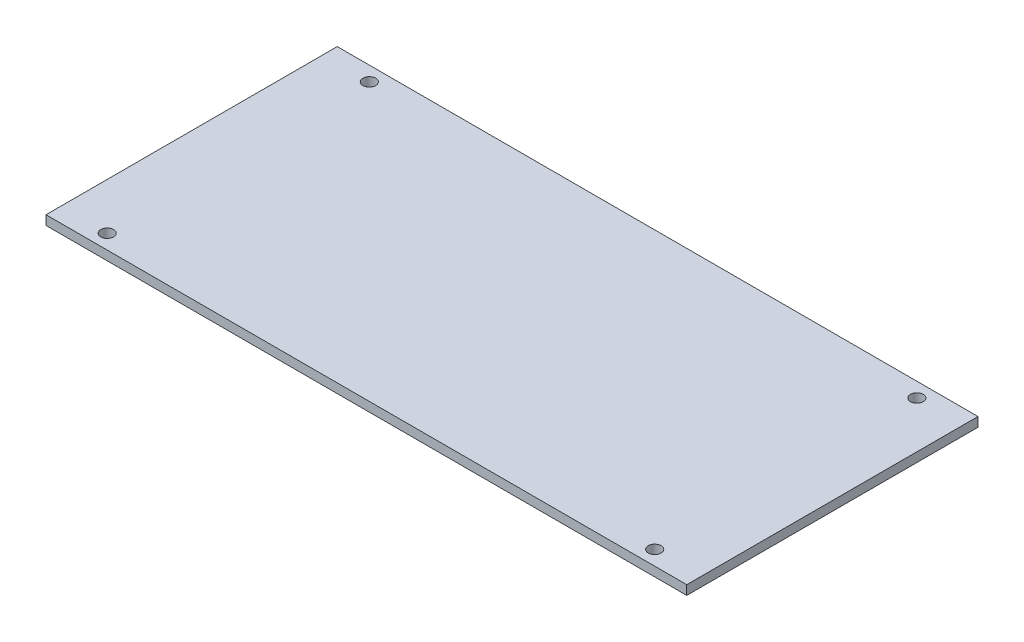
ISO-10303-21;
HEADER;
FILE_DESCRIPTION(('STEP AP214'),'2;1');
FILE_NAME('part.step','',(''),(''),'','','');
FILE_SCHEMA(('AUTOMOTIVE_DESIGN { 1 0 10303 214 1 1 1 1 }'));
ENDSEC;
DATA;
#1=APPLICATION_CONTEXT('core data for automotive mechanical design processes');
#2=APPLICATION_PROTOCOL_DEFINITION('international standard','automotive_design',2000,#1);
#3=PRODUCT_CONTEXT('',#1,'mechanical');
#4=PRODUCT('Part','Part','',(#3));
#5=PRODUCT_RELATED_PRODUCT_CATEGORY('part','',(#4));
#6=PRODUCT_DEFINITION_FORMATION('','',#4);
#7=PRODUCT_DEFINITION_CONTEXT('part definition',#1,'design');
#8=PRODUCT_DEFINITION('design','',#6,#7);
#9=PRODUCT_DEFINITION_SHAPE('','',#8);
#10=(LENGTH_UNIT() NAMED_UNIT(*) SI_UNIT(.MILLI.,.METRE.));
#11=(NAMED_UNIT(*) PLANE_ANGLE_UNIT() SI_UNIT($,.RADIAN.));
#12=(NAMED_UNIT(*) SI_UNIT($,.STERADIAN.) SOLID_ANGLE_UNIT());
#13=UNCERTAINTY_MEASURE_WITH_UNIT(LENGTH_MEASURE(1.E-05),#10,'distance_accuracy_value','');
#14=(GEOMETRIC_REPRESENTATION_CONTEXT(3) GLOBAL_UNCERTAINTY_ASSIGNED_CONTEXT((#13)) GLOBAL_UNIT_ASSIGNED_CONTEXT((#10,
#11,#12)) REPRESENTATION_CONTEXT('',''));
#15=CARTESIAN_POINT('',(0.,0.,0.));
#16=DIRECTION('',(0.,0.,1.));
#17=DIRECTION('',(1.,0.,0.));
#18=AXIS2_PLACEMENT_3D('',#15,#16,#17);
#19=CARTESIAN_POINT('',(69.85,2.032,31.75));
#20=DIRECTION('',(-1.,0.,0.));
#21=DIRECTION('',(0.,0.,1.));
#22=AXIS2_PLACEMENT_3D('',#19,#20,#21);
#23=PLANE('',#22);
#24=DIRECTION('',(0.,0.,-1.));
#25=VECTOR('',#24,1.);
#26=CARTESIAN_POINT('',(69.85,0.,31.75));
#27=LINE('',#26,#25);
#28=CARTESIAN_POINT('',(69.85,0.,31.75));
#29=VERTEX_POINT('',#28);
#30=CARTESIAN_POINT('',(69.85,0.,-31.75));
#31=VERTEX_POINT('',#30);
#32=EDGE_CURVE('E96',#29,#31,#27,.T.);
#33=ORIENTED_EDGE('',*,*,#32,.T.);
#34=DIRECTION('',(0.,-1.,0.));
#35=VECTOR('',#34,1.);
#36=CARTESIAN_POINT('',(69.85,2.032,-31.75));
#37=LINE('',#36,#35);
#38=CARTESIAN_POINT('',(69.85,2.032,-31.75));
#39=VERTEX_POINT('',#38);
#40=EDGE_CURVE('E11',#39,#31,#37,.T.);
#41=ORIENTED_EDGE('',*,*,#40,.F.);
#42=DIRECTION('',(0.,0.,-1.));
#43=VECTOR('',#42,1.);
#44=CARTESIAN_POINT('',(69.85,2.032,31.75));
#45=LINE('',#44,#43);
#46=CARTESIAN_POINT('',(69.85,2.032,31.75));
#47=VERTEX_POINT('',#46);
#48=EDGE_CURVE('E84',#47,#39,#45,.T.);
#49=ORIENTED_EDGE('',*,*,#48,.F.);
#50=DIRECTION('',(0.,-1.,0.));
#51=VECTOR('',#50,1.);
#52=CARTESIAN_POINT('',(69.85,2.032,31.75));
#53=LINE('',#52,#51);
#54=EDGE_CURVE('E92',#47,#29,#53,.T.);
#55=ORIENTED_EDGE('',*,*,#54,.T.);
#56=EDGE_LOOP('',(#33,#41,#49,#55));
#57=FACE_BOUND('',#56,.T.);
#58=ADVANCED_FACE('F33',(#57),#23,.F.);
#59=CARTESIAN_POINT('',(-69.85,2.032,-31.75));
#60=DIRECTION('',(0.,0.,1.));
#61=DIRECTION('',(1.,0.,0.));
#62=AXIS2_PLACEMENT_3D('',#59,#60,#61);
#63=PLANE('',#62);
#64=DIRECTION('',(-1.,0.,0.));
#65=VECTOR('',#64,1.);
#66=CARTESIAN_POINT('',(-69.85,0.,-31.75));
#67=LINE('',#66,#65);
#68=CARTESIAN_POINT('',(-69.85,0.,-31.75));
#69=VERTEX_POINT('',#68);
#70=EDGE_CURVE('E88',#31,#69,#67,.T.);
#71=ORIENTED_EDGE('',*,*,#70,.T.);
#72=DIRECTION('',(0.,-1.,0.));
#73=VECTOR('',#72,1.);
#74=CARTESIAN_POINT('',(-69.85,2.032,-31.75));
#75=LINE('',#74,#73);
#76=CARTESIAN_POINT('',(-69.85,2.032,-31.75));
#77=VERTEX_POINT('',#76);
#78=EDGE_CURVE('E41',#77,#69,#75,.T.);
#79=ORIENTED_EDGE('',*,*,#78,.F.);
#80=DIRECTION('',(-1.,0.,0.));
#81=VECTOR('',#80,1.);
#82=CARTESIAN_POINT('',(-69.85,2.032,-31.75));
#83=LINE('',#82,#81);
#84=EDGE_CURVE('E79',#39,#77,#83,.T.);
#85=ORIENTED_EDGE('',*,*,#84,.F.);
#86=ORIENTED_EDGE('',*,*,#40,.T.);
#87=EDGE_LOOP('',(#71,#79,#85,#86));
#88=FACE_BOUND('',#87,.T.);
#89=ADVANCED_FACE('F87',(#88),#63,.F.);
#90=CARTESIAN_POINT('',(-69.85,2.032,31.75));
#91=DIRECTION('',(1.,0.,0.));
#92=DIRECTION('',(0.,0.,-1.));
#93=AXIS2_PLACEMENT_3D('',#90,#91,#92);
#94=PLANE('',#93);
#95=DIRECTION('',(0.,0.,1.));
#96=VECTOR('',#95,1.);
#97=CARTESIAN_POINT('',(-69.85,0.,31.75));
#98=LINE('',#97,#96);
#99=CARTESIAN_POINT('',(-69.85,0.,31.75));
#100=VERTEX_POINT('',#99);
#101=EDGE_CURVE('E66',#69,#100,#98,.T.);
#102=ORIENTED_EDGE('',*,*,#101,.T.);
#103=DIRECTION('',(0.,-1.,0.));
#104=VECTOR('',#103,1.);
#105=CARTESIAN_POINT('',(-69.85,2.032,31.75));
#106=LINE('',#105,#104);
#107=CARTESIAN_POINT('',(-69.85,2.032,31.75));
#108=VERTEX_POINT('',#107);
#109=EDGE_CURVE('E89',#108,#100,#106,.T.);
#110=ORIENTED_EDGE('',*,*,#109,.F.);
#111=DIRECTION('',(0.,0.,1.));
#112=VECTOR('',#111,1.);
#113=CARTESIAN_POINT('',(-69.85,2.032,31.75));
#114=LINE('',#113,#112);
#115=EDGE_CURVE('E82',#77,#108,#114,.T.);
#116=ORIENTED_EDGE('',*,*,#115,.F.);
#117=ORIENTED_EDGE('',*,*,#78,.T.);
#118=EDGE_LOOP('',(#102,#110,#116,#117));
#119=FACE_BOUND('',#118,.T.);
#120=ADVANCED_FACE('F90',(#119),#94,.F.);
#121=CARTESIAN_POINT('',(-69.85,2.032,31.75));
#122=DIRECTION('',(0.,0.,-1.));
#123=DIRECTION('',(-1.,0.,0.));
#124=AXIS2_PLACEMENT_3D('',#121,#122,#123);
#125=PLANE('',#124);
#126=DIRECTION('',(1.,0.,0.));
#127=VECTOR('',#126,1.);
#128=CARTESIAN_POINT('',(-69.85,0.,31.75));
#129=LINE('',#128,#127);
#130=EDGE_CURVE('E72',#100,#29,#129,.T.);
#131=ORIENTED_EDGE('',*,*,#130,.T.);
#132=ORIENTED_EDGE('',*,*,#54,.F.);
#133=DIRECTION('',(1.,0.,0.));
#134=VECTOR('',#133,1.);
#135=CARTESIAN_POINT('',(-69.85,2.032,31.75));
#136=LINE('',#135,#134);
#137=EDGE_CURVE('E49',#108,#47,#136,.T.);
#138=ORIENTED_EDGE('',*,*,#137,.F.);
#139=ORIENTED_EDGE('',*,*,#109,.T.);
#140=EDGE_LOOP('',(#131,#132,#138,#139));
#141=FACE_BOUND('',#140,.T.);
#142=ADVANCED_FACE('F104',(#141),#125,.F.);
#143=CARTESIAN_POINT('',(0.,2.032,0.));
#144=DIRECTION('',(0.,-1.,0.));
#145=DIRECTION('',(0.,0.,-1.));
#146=AXIS2_PLACEMENT_3D('',#143,#144,#145);
#147=PLANE('',#146);
#148=CARTESIAN_POINT('',(-59.69,2.032,28.575));
#149=DIRECTION('',(0.,1.,0.));
#150=DIRECTION('',(0.,0.,1.));
#151=AXIS2_PLACEMENT_3D('',#148,#149,#150);
#152=CIRCLE('',#151,1.39699999999999);
#153=CARTESIAN_POINT('',(-59.69,2.032,29.972));
#154=VERTEX_POINT('',#153);
#155=EDGE_CURVE('E128',#154,#154,#152,.T.);
#156=ORIENTED_EDGE('',*,*,#155,.F.);
#157=EDGE_LOOP('',(#156));
#158=FACE_BOUND('',#157,.T.);
#159=CARTESIAN_POINT('',(59.69,2.032,28.575));
#160=DIRECTION('',(0.,1.,0.));
#161=DIRECTION('',(0.,0.,-1.));
#162=AXIS2_PLACEMENT_3D('',#159,#160,#161);
#163=CIRCLE('',#162,1.39699999999999);
#164=CARTESIAN_POINT('',(59.69,2.032,27.178));
#165=VERTEX_POINT('',#164);
#166=EDGE_CURVE('E122',#165,#165,#163,.T.);
#167=ORIENTED_EDGE('',*,*,#166,.F.);
#168=EDGE_LOOP('',(#167));
#169=FACE_BOUND('',#168,.T.);
#170=CARTESIAN_POINT('',(-59.69,2.032,-28.575));
#171=DIRECTION('',(0.,1.,0.));
#172=DIRECTION('',(0.,0.,-1.));
#173=AXIS2_PLACEMENT_3D('',#170,#171,#172);
#174=CIRCLE('',#173,1.39699999999999);
#175=CARTESIAN_POINT('',(-59.69,2.032,-29.972));
#176=VERTEX_POINT('',#175);
#177=EDGE_CURVE('E116',#176,#176,#174,.T.);
#178=ORIENTED_EDGE('',*,*,#177,.F.);
#179=EDGE_LOOP('',(#178));
#180=FACE_BOUND('',#179,.T.);
#181=CARTESIAN_POINT('',(59.69,2.032,-28.575));
#182=DIRECTION('',(0.,1.,0.));
#183=DIRECTION('',(0.,0.,1.));
#184=AXIS2_PLACEMENT_3D('',#181,#182,#183);
#185=CIRCLE('',#184,1.39699999999999);
#186=CARTESIAN_POINT('',(59.69,2.032,-27.178));
#187=VERTEX_POINT('',#186);
#188=EDGE_CURVE('E110',#187,#187,#185,.T.);
#189=ORIENTED_EDGE('',*,*,#188,.F.);
#190=EDGE_LOOP('',(#189));
#191=FACE_BOUND('',#190,.T.);
#192=ORIENTED_EDGE('',*,*,#48,.T.);
#193=ORIENTED_EDGE('',*,*,#84,.T.);
#194=ORIENTED_EDGE('',*,*,#115,.T.);
#195=ORIENTED_EDGE('',*,*,#137,.T.);
#196=EDGE_LOOP('',(#192,#193,#194,#195));
#197=FACE_BOUND('',#196,.T.);
#198=ADVANCED_FACE('F80',(#158,#169,#180,#191,#197),#147,.F.);
#199=CARTESIAN_POINT('',(0.,0.,0.));
#200=DIRECTION('',(0.,-1.,0.));
#201=DIRECTION('',(0.,0.,-1.));
#202=AXIS2_PLACEMENT_3D('',#199,#200,#201);
#203=PLANE('',#202);
#204=CARTESIAN_POINT('',(-59.69,0.,28.575));
#205=DIRECTION('',(0.,1.,0.));
#206=DIRECTION('',(0.,0.,1.));
#207=AXIS2_PLACEMENT_3D('',#204,#205,#206);
#208=CIRCLE('',#207,1.39699999999999);
#209=CARTESIAN_POINT('',(-59.69,0.,29.972));
#210=VERTEX_POINT('',#209);
#211=EDGE_CURVE('E125',#210,#210,#208,.T.);
#212=ORIENTED_EDGE('',*,*,#211,.T.);
#213=EDGE_LOOP('',(#212));
#214=FACE_BOUND('',#213,.T.);
#215=CARTESIAN_POINT('',(59.69,0.,28.575));
#216=DIRECTION('',(0.,1.,0.));
#217=DIRECTION('',(0.,0.,-1.));
#218=AXIS2_PLACEMENT_3D('',#215,#216,#217);
#219=CIRCLE('',#218,1.39699999999999);
#220=CARTESIAN_POINT('',(59.69,0.,27.178));
#221=VERTEX_POINT('',#220);
#222=EDGE_CURVE('E119',#221,#221,#219,.T.);
#223=ORIENTED_EDGE('',*,*,#222,.T.);
#224=EDGE_LOOP('',(#223));
#225=FACE_BOUND('',#224,.T.);
#226=CARTESIAN_POINT('',(-59.69,0.,-28.575));
#227=DIRECTION('',(0.,1.,0.));
#228=DIRECTION('',(0.,0.,-1.));
#229=AXIS2_PLACEMENT_3D('',#226,#227,#228);
#230=CIRCLE('',#229,1.39699999999999);
#231=CARTESIAN_POINT('',(-59.69,0.,-29.972));
#232=VERTEX_POINT('',#231);
#233=EDGE_CURVE('E113',#232,#232,#230,.T.);
#234=ORIENTED_EDGE('',*,*,#233,.T.);
#235=EDGE_LOOP('',(#234));
#236=FACE_BOUND('',#235,.T.);
#237=CARTESIAN_POINT('',(59.69,0.,-28.575));
#238=DIRECTION('',(0.,1.,0.));
#239=DIRECTION('',(0.,0.,1.));
#240=AXIS2_PLACEMENT_3D('',#237,#238,#239);
#241=CIRCLE('',#240,1.39699999999999);
#242=CARTESIAN_POINT('',(59.69,0.,-27.178));
#243=VERTEX_POINT('',#242);
#244=EDGE_CURVE('E99',#243,#243,#241,.T.);
#245=ORIENTED_EDGE('',*,*,#244,.T.);
#246=EDGE_LOOP('',(#245));
#247=FACE_BOUND('',#246,.T.);
#248=ORIENTED_EDGE('',*,*,#32,.F.);
#249=ORIENTED_EDGE('',*,*,#130,.F.);
#250=ORIENTED_EDGE('',*,*,#101,.F.);
#251=ORIENTED_EDGE('',*,*,#70,.F.);
#252=EDGE_LOOP('',(#248,#249,#250,#251));
#253=FACE_BOUND('',#252,.T.);
#254=ADVANCED_FACE('F107',(#214,#225,#236,#247,#253),#203,.T.);
#255=CARTESIAN_POINT('',(59.69,0.,-28.575));
#256=DIRECTION('',(0.,1.,0.));
#257=DIRECTION('',(0.,0.,1.));
#258=AXIS2_PLACEMENT_3D('',#255,#256,#257);
#259=CYLINDRICAL_SURFACE('',#258,1.39699999999999);
#260=ORIENTED_EDGE('',*,*,#244,.F.);
#261=EDGE_LOOP('',(#260));
#262=FACE_BOUND('',#261,.T.);
#263=ORIENTED_EDGE('',*,*,#188,.T.);
#264=EDGE_LOOP('',(#263));
#265=FACE_BOUND('',#264,.T.);
#266=ADVANCED_FACE('F152',(#262,#265),#259,.F.);
#267=CARTESIAN_POINT('',(-59.69,0.,-28.575));
#268=DIRECTION('',(0.,1.,0.));
#269=DIRECTION('',(0.,0.,1.));
#270=AXIS2_PLACEMENT_3D('',#267,#268,#269);
#271=CYLINDRICAL_SURFACE('',#270,1.39699999999999);
#272=ORIENTED_EDGE('',*,*,#233,.F.);
#273=EDGE_LOOP('',(#272));
#274=FACE_BOUND('',#273,.T.);
#275=ORIENTED_EDGE('',*,*,#177,.T.);
#276=EDGE_LOOP('',(#275));
#277=FACE_BOUND('',#276,.T.);
#278=ADVANCED_FACE('F154',(#274,#277),#271,.F.);
#279=CARTESIAN_POINT('',(59.69,0.,28.575));
#280=DIRECTION('',(0.,1.,0.));
#281=DIRECTION('',(0.,0.,1.));
#282=AXIS2_PLACEMENT_3D('',#279,#280,#281);
#283=CYLINDRICAL_SURFACE('',#282,1.39699999999999);
#284=ORIENTED_EDGE('',*,*,#222,.F.);
#285=EDGE_LOOP('',(#284));
#286=FACE_BOUND('',#285,.T.);
#287=ORIENTED_EDGE('',*,*,#166,.T.);
#288=EDGE_LOOP('',(#287));
#289=FACE_BOUND('',#288,.T.);
#290=ADVANCED_FACE('F139',(#286,#289),#283,.F.);
#291=CARTESIAN_POINT('',(-59.69,0.,28.575));
#292=DIRECTION('',(0.,1.,0.));
#293=DIRECTION('',(0.,0.,1.));
#294=AXIS2_PLACEMENT_3D('',#291,#292,#293);
#295=CYLINDRICAL_SURFACE('',#294,1.39699999999999);
#296=ORIENTED_EDGE('',*,*,#211,.F.);
#297=EDGE_LOOP('',(#296));
#298=FACE_BOUND('',#297,.T.);
#299=ORIENTED_EDGE('',*,*,#155,.T.);
#300=EDGE_LOOP('',(#299));
#301=FACE_BOUND('',#300,.T.);
#302=ADVANCED_FACE('F136',(#298,#301),#295,.F.);
#303=CLOSED_SHELL('',(#58,#89,#120,#142,#198,#254,#266,#278,#290,#302));
#304=MANIFOLD_SOLID_BREP('B2',#303);
#305=ADVANCED_BREP_SHAPE_REPRESENTATION('',(#18,#304),#14);
#306=SHAPE_DEFINITION_REPRESENTATION(#9,#305);
ENDSEC;
END-ISO-10303-21;
